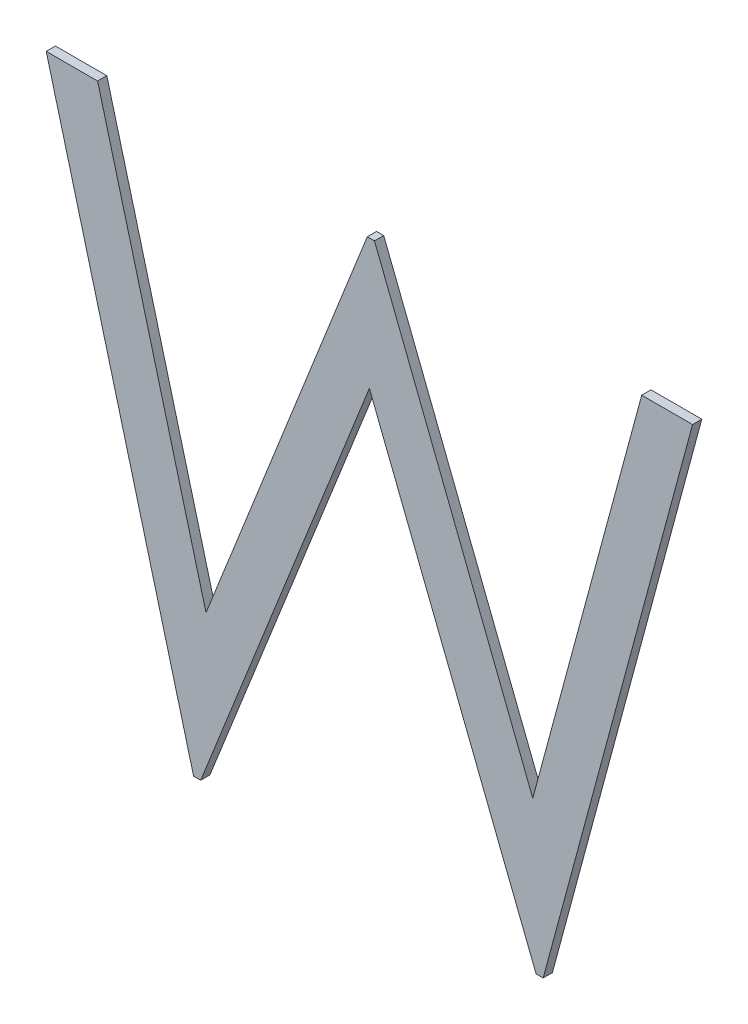
ISO-10303-21;
HEADER;
FILE_DESCRIPTION(('STEP AP214'),'2;1');
FILE_NAME('part.step','',(''),(''),'','','');
FILE_SCHEMA(('AUTOMOTIVE_DESIGN { 1 0 10303 214 1 1 1 1 }'));
ENDSEC;
DATA;
#1=APPLICATION_CONTEXT('core data for automotive mechanical design processes');
#2=APPLICATION_PROTOCOL_DEFINITION('international standard','automotive_design',2000,#1);
#3=PRODUCT_CONTEXT('',#1,'mechanical');
#4=PRODUCT('Part','Part','',(#3));
#5=PRODUCT_RELATED_PRODUCT_CATEGORY('part','',(#4));
#6=PRODUCT_DEFINITION_FORMATION('','',#4);
#7=PRODUCT_DEFINITION_CONTEXT('part definition',#1,'design');
#8=PRODUCT_DEFINITION('design','',#6,#7);
#9=PRODUCT_DEFINITION_SHAPE('','',#8);
#10=(LENGTH_UNIT() NAMED_UNIT(*) SI_UNIT(.MILLI.,.METRE.));
#11=(NAMED_UNIT(*) PLANE_ANGLE_UNIT() SI_UNIT($,.RADIAN.));
#12=(NAMED_UNIT(*) SI_UNIT($,.STERADIAN.) SOLID_ANGLE_UNIT());
#13=UNCERTAINTY_MEASURE_WITH_UNIT(LENGTH_MEASURE(1.E-05),#10,'distance_accuracy_value','');
#14=(GEOMETRIC_REPRESENTATION_CONTEXT(3) GLOBAL_UNCERTAINTY_ASSIGNED_CONTEXT((#13)) GLOBAL_UNIT_ASSIGNED_CONTEXT((#10,
#11,#12)) REPRESENTATION_CONTEXT('',''));
#15=CARTESIAN_POINT('',(0.,0.,0.));
#16=DIRECTION('',(0.,0.,1.));
#17=DIRECTION('',(1.,0.,0.));
#18=AXIS2_PLACEMENT_3D('',#15,#16,#17);
#19=CARTESIAN_POINT('',(0.595961538461539,0.858883956160389,0.551));
#20=DIRECTION('',(-0.966388993927676,-0.257084251589735,0.));
#21=DIRECTION('',(0.257084251589735,-0.966388993927676,0.));
#22=AXIS2_PLACEMENT_3D('',#19,#20,#21);
#23=PLANE('',#22);
#24=DIRECTION('',(-0.257084251589734,0.966388993927676,0.));
#25=VECTOR('',#24,1.);
#26=CARTESIAN_POINT('',(0.595961538461539,0.858883956160389,0.55));
#27=LINE('',#26,#25);
#28=CARTESIAN_POINT('',(0.595961538461539,0.858883956160389,0.55));
#29=VERTEX_POINT('',#28);
#30=CARTESIAN_POINT('',(0.58,0.918883956160389,0.55));
#31=VERTEX_POINT('',#30);
#32=EDGE_CURVE('E11',#29,#31,#27,.T.);
#33=ORIENTED_EDGE('',*,*,#32,.F.);
#34=DIRECTION('',(0.,0.,-1.));
#35=VECTOR('',#34,1.);
#36=CARTESIAN_POINT('',(0.595961538461539,0.858883956160389,0.551));
#37=LINE('',#36,#35);
#38=CARTESIAN_POINT('',(0.595961538461539,0.858883956160389,0.551));
#39=VERTEX_POINT('',#38);
#40=EDGE_CURVE('E224',#39,#29,#37,.T.);
#41=ORIENTED_EDGE('',*,*,#40,.F.);
#42=DIRECTION('',(-0.257084251589734,0.966388993927676,0.));
#43=VECTOR('',#42,1.);
#44=CARTESIAN_POINT('',(0.595961538461539,0.858883956160389,0.551));
#45=LINE('',#44,#43);
#46=CARTESIAN_POINT('',(0.58,0.918883956160389,0.551));
#47=VERTEX_POINT('',#46);
#48=EDGE_CURVE('E217',#39,#47,#45,.T.);
#49=ORIENTED_EDGE('',*,*,#48,.T.);
#50=DIRECTION('',(0.,0.,-1.));
#51=VECTOR('',#50,1.);
#52=CARTESIAN_POINT('',(0.58,0.918883956160389,0.551));
#53=LINE('',#52,#51);
#54=EDGE_CURVE('E127',#47,#31,#53,.T.);
#55=ORIENTED_EDGE('',*,*,#54,.T.);
#56=EDGE_LOOP('',(#33,#41,#49,#55));
#57=FACE_BOUND('',#56,.T.);
#58=ADVANCED_FACE('F17',(#57),#23,.T.);
#59=CARTESIAN_POINT('',(0.596730769230769,0.858883956160389,0.551));
#60=DIRECTION('',(0.,-1.,0.));
#61=DIRECTION('',(0.,0.,-1.));
#62=AXIS2_PLACEMENT_3D('',#59,#60,#61);
#63=PLANE('',#62);
#64=DIRECTION('',(-1.,0.,0.));
#65=VECTOR('',#64,1.);
#66=CARTESIAN_POINT('',(0.596730769230769,0.858883956160389,0.55));
#67=LINE('',#66,#65);
#68=CARTESIAN_POINT('',(0.596730769230769,0.858883956160389,0.55));
#69=VERTEX_POINT('',#68);
#70=EDGE_CURVE('E24',#69,#29,#67,.T.);
#71=ORIENTED_EDGE('',*,*,#70,.F.);
#72=DIRECTION('',(0.,0.,-1.));
#73=VECTOR('',#72,1.);
#74=CARTESIAN_POINT('',(0.596730769230769,0.858883956160389,0.551));
#75=LINE('',#74,#73);
#76=CARTESIAN_POINT('',(0.596730769230769,0.858883956160389,0.551));
#77=VERTEX_POINT('',#76);
#78=EDGE_CURVE('E219',#77,#69,#75,.T.);
#79=ORIENTED_EDGE('',*,*,#78,.F.);
#80=DIRECTION('',(-1.,0.,0.));
#81=VECTOR('',#80,1.);
#82=CARTESIAN_POINT('',(0.596730769230769,0.858883956160389,0.551));
#83=LINE('',#82,#81);
#84=EDGE_CURVE('E208',#77,#39,#83,.T.);
#85=ORIENTED_EDGE('',*,*,#84,.T.);
#86=ORIENTED_EDGE('',*,*,#40,.T.);
#87=EDGE_LOOP('',(#71,#79,#85,#86));
#88=FACE_BOUND('',#87,.T.);
#89=ADVANCED_FACE('F235',(#88),#63,.T.);
#90=CARTESIAN_POINT('',(0.615,0.904773379237312,0.551));
#91=DIRECTION('',(0.929079621725964,-0.369879786543601,0.));
#92=DIRECTION('',(0.369879786543601,0.929079621725964,0.));
#93=AXIS2_PLACEMENT_3D('',#90,#91,#92);
#94=PLANE('',#93);
#95=DIRECTION('',(-0.3698797865436,-0.929079621725964,0.));
#96=VECTOR('',#95,1.);
#97=CARTESIAN_POINT('',(0.615,0.904773379237312,0.55));
#98=LINE('',#97,#96);
#99=CARTESIAN_POINT('',(0.615,0.904773379237312,0.55));
#100=VERTEX_POINT('',#99);
#101=EDGE_CURVE('E221',#100,#69,#98,.T.);
#102=ORIENTED_EDGE('',*,*,#101,.F.);
#103=DIRECTION('',(0.,0.,-1.));
#104=VECTOR('',#103,1.);
#105=CARTESIAN_POINT('',(0.615,0.904773379237312,0.551));
#106=LINE('',#105,#104);
#107=CARTESIAN_POINT('',(0.615,0.904773379237312,0.551));
#108=VERTEX_POINT('',#107);
#109=EDGE_CURVE('E211',#108,#100,#106,.T.);
#110=ORIENTED_EDGE('',*,*,#109,.F.);
#111=DIRECTION('',(-0.3698797865436,-0.929079621725964,0.));
#112=VECTOR('',#111,1.);
#113=CARTESIAN_POINT('',(0.615,0.904773379237312,0.551));
#114=LINE('',#113,#112);
#115=EDGE_CURVE('E198',#108,#77,#114,.T.);
#116=ORIENTED_EDGE('',*,*,#115,.T.);
#117=ORIENTED_EDGE('',*,*,#78,.T.);
#118=EDGE_LOOP('',(#102,#110,#116,#117));
#119=FACE_BOUND('',#118,.T.);
#120=ADVANCED_FACE('F228',(#119),#94,.T.);
#121=CARTESIAN_POINT('',(0.633052884615385,0.858883956160389,0.551));
#122=DIRECTION('',(-0.930579564355999,-0.366089708135859,0.));
#123=DIRECTION('',(0.366089708135859,-0.930579564355999,0.));
#124=AXIS2_PLACEMENT_3D('',#121,#122,#123);
#125=PLANE('',#124);
#126=DIRECTION('',(-0.366089708135859,0.930579564355999,0.));
#127=VECTOR('',#126,1.);
#128=CARTESIAN_POINT('',(0.633052884615385,0.858883956160389,0.55));
#129=LINE('',#128,#127);
#130=CARTESIAN_POINT('',(0.633052884615385,0.858883956160389,0.55));
#131=VERTEX_POINT('',#130);
#132=EDGE_CURVE('E214',#131,#100,#129,.T.);
#133=ORIENTED_EDGE('',*,*,#132,.F.);
#134=DIRECTION('',(0.,0.,-1.));
#135=VECTOR('',#134,1.);
#136=CARTESIAN_POINT('',(0.633052884615385,0.858883956160389,0.551));
#137=LINE('',#136,#135);
#138=CARTESIAN_POINT('',(0.633052884615385,0.858883956160389,0.551));
#139=VERTEX_POINT('',#138);
#140=EDGE_CURVE('E201',#139,#131,#137,.T.);
#141=ORIENTED_EDGE('',*,*,#140,.F.);
#142=DIRECTION('',(-0.366089708135859,0.930579564355999,0.));
#143=VECTOR('',#142,1.);
#144=CARTESIAN_POINT('',(0.633052884615385,0.858883956160389,0.551));
#145=LINE('',#144,#143);
#146=EDGE_CURVE('E189',#139,#108,#145,.T.);
#147=ORIENTED_EDGE('',*,*,#146,.T.);
#148=ORIENTED_EDGE('',*,*,#109,.T.);
#149=EDGE_LOOP('',(#133,#141,#147,#148));
#150=FACE_BOUND('',#149,.T.);
#151=ADVANCED_FACE('F230',(#150),#125,.T.);
#152=CARTESIAN_POINT('',(0.633822115384616,0.858883956160389,0.551));
#153=DIRECTION('',(0.,-1.,0.));
#154=DIRECTION('',(0.,0.,-1.));
#155=AXIS2_PLACEMENT_3D('',#152,#153,#154);
#156=PLANE('',#155);
#157=DIRECTION('',(-1.,0.,0.));
#158=VECTOR('',#157,1.);
#159=CARTESIAN_POINT('',(0.633822115384616,0.858883956160389,0.55));
#160=LINE('',#159,#158);
#161=CARTESIAN_POINT('',(0.633822115384616,0.858883956160389,0.55));
#162=VERTEX_POINT('',#161);
#163=EDGE_CURVE('E204',#162,#131,#160,.T.);
#164=ORIENTED_EDGE('',*,*,#163,.F.);
#165=DIRECTION('',(0.,0.,-1.));
#166=VECTOR('',#165,1.);
#167=CARTESIAN_POINT('',(0.633822115384616,0.858883956160389,0.551));
#168=LINE('',#167,#166);
#169=CARTESIAN_POINT('',(0.633822115384616,0.858883956160389,0.551));
#170=VERTEX_POINT('',#169);
#171=EDGE_CURVE('E192',#170,#162,#168,.T.);
#172=ORIENTED_EDGE('',*,*,#171,.F.);
#173=DIRECTION('',(-1.,0.,0.));
#174=VECTOR('',#173,1.);
#175=CARTESIAN_POINT('',(0.633822115384616,0.858883956160389,0.551));
#176=LINE('',#175,#174);
#177=EDGE_CURVE('E180',#170,#139,#176,.T.);
#178=ORIENTED_EDGE('',*,*,#177,.T.);
#179=ORIENTED_EDGE('',*,*,#140,.T.);
#180=EDGE_LOOP('',(#164,#172,#178,#179));
#181=FACE_BOUND('',#180,.T.);
#182=ADVANCED_FACE('F253',(#181),#156,.T.);
#183=CARTESIAN_POINT('',(0.65,0.918883956160389,0.551));
#184=DIRECTION('',(0.965518584404461,-0.260334137541747,0.));
#185=DIRECTION('',(0.260334137541747,0.965518584404461,0.));
#186=AXIS2_PLACEMENT_3D('',#183,#184,#185);
#187=PLANE('',#186);
#188=DIRECTION('',(-0.260334137541746,-0.965518584404461,0.));
#189=VECTOR('',#188,1.);
#190=CARTESIAN_POINT('',(0.65,0.918883956160389,0.55));
#191=LINE('',#190,#189);
#192=CARTESIAN_POINT('',(0.65,0.918883956160389,0.55));
#193=VERTEX_POINT('',#192);
#194=EDGE_CURVE('E195',#193,#162,#191,.T.);
#195=ORIENTED_EDGE('',*,*,#194,.F.);
#196=DIRECTION('',(0.,0.,-1.));
#197=VECTOR('',#196,1.);
#198=CARTESIAN_POINT('',(0.65,0.918883956160389,0.551));
#199=LINE('',#198,#197);
#200=CARTESIAN_POINT('',(0.65,0.918883956160389,0.551));
#201=VERTEX_POINT('',#200);
#202=EDGE_CURVE('E183',#201,#193,#199,.T.);
#203=ORIENTED_EDGE('',*,*,#202,.F.);
#204=DIRECTION('',(-0.260334137541746,-0.965518584404461,0.));
#205=VECTOR('',#204,1.);
#206=CARTESIAN_POINT('',(0.65,0.918883956160389,0.551));
#207=LINE('',#206,#205);
#208=EDGE_CURVE('E171',#201,#170,#207,.T.);
#209=ORIENTED_EDGE('',*,*,#208,.T.);
#210=ORIENTED_EDGE('',*,*,#171,.T.);
#211=EDGE_LOOP('',(#195,#203,#209,#210));
#212=FACE_BOUND('',#211,.T.);
#213=ADVANCED_FACE('F251',(#212),#187,.T.);
#214=CARTESIAN_POINT('',(0.644495192307693,0.918883956160389,0.551));
#215=DIRECTION('',(0.,1.,0.));
#216=DIRECTION('',(0.,0.,1.));
#217=AXIS2_PLACEMENT_3D('',#214,#215,#216);
#218=PLANE('',#217);
#219=DIRECTION('',(1.,0.,0.));
#220=VECTOR('',#219,1.);
#221=CARTESIAN_POINT('',(0.644495192307693,0.918883956160389,0.55));
#222=LINE('',#221,#220);
#223=CARTESIAN_POINT('',(0.644495192307693,0.918883956160389,0.55));
#224=VERTEX_POINT('',#223);
#225=EDGE_CURVE('E186',#224,#193,#222,.T.);
#226=ORIENTED_EDGE('',*,*,#225,.F.);
#227=DIRECTION('',(0.,0.,-1.));
#228=VECTOR('',#227,1.);
#229=CARTESIAN_POINT('',(0.644495192307693,0.918883956160389,0.551));
#230=LINE('',#229,#228);
#231=CARTESIAN_POINT('',(0.644495192307693,0.918883956160389,0.551));
#232=VERTEX_POINT('',#231);
#233=EDGE_CURVE('E174',#232,#224,#230,.T.);
#234=ORIENTED_EDGE('',*,*,#233,.F.);
#235=DIRECTION('',(1.,0.,0.));
#236=VECTOR('',#235,1.);
#237=CARTESIAN_POINT('',(0.644495192307693,0.918883956160389,0.551));
#238=LINE('',#237,#236);
#239=EDGE_CURVE('E162',#232,#201,#238,.T.);
#240=ORIENTED_EDGE('',*,*,#239,.T.);
#241=ORIENTED_EDGE('',*,*,#202,.T.);
#242=EDGE_LOOP('',(#226,#234,#240,#241));
#243=FACE_BOUND('',#242,.T.);
#244=ADVANCED_FACE('F248',(#243),#218,.T.);
#245=CARTESIAN_POINT('',(0.632692307692308,0.875182033083466,0.551));
#246=DIRECTION('',(-0.965410371069074,0.260735144221626,0.));
#247=DIRECTION('',(-0.260735144221626,-0.965410371069074,0.));
#248=AXIS2_PLACEMENT_3D('',#245,#246,#247);
#249=PLANE('',#248);
#250=DIRECTION('',(0.260735144221626,0.965410371069074,0.));
#251=VECTOR('',#250,1.);
#252=CARTESIAN_POINT('',(0.632692307692308,0.875182033083466,0.55));
#253=LINE('',#252,#251);
#254=CARTESIAN_POINT('',(0.632692307692308,0.875182033083466,0.55));
#255=VERTEX_POINT('',#254);
#256=EDGE_CURVE('E177',#255,#224,#253,.T.);
#257=ORIENTED_EDGE('',*,*,#256,.F.);
#258=DIRECTION('',(0.,0.,-1.));
#259=VECTOR('',#258,1.);
#260=CARTESIAN_POINT('',(0.632692307692308,0.875182033083466,0.551));
#261=LINE('',#260,#259);
#262=CARTESIAN_POINT('',(0.632692307692308,0.875182033083466,0.551));
#263=VERTEX_POINT('',#262);
#264=EDGE_CURVE('E165',#263,#255,#261,.T.);
#265=ORIENTED_EDGE('',*,*,#264,.F.);
#266=DIRECTION('',(0.260735144221626,0.965410371069074,0.));
#267=VECTOR('',#266,1.);
#268=CARTESIAN_POINT('',(0.632692307692308,0.875182033083466,0.551));
#269=LINE('',#268,#267);
#270=EDGE_CURVE('E153',#263,#232,#269,.T.);
#271=ORIENTED_EDGE('',*,*,#270,.T.);
#272=ORIENTED_EDGE('',*,*,#233,.T.);
#273=EDGE_LOOP('',(#257,#265,#271,#272));
#274=FACE_BOUND('',#273,.T.);
#275=ADVANCED_FACE('F245',(#274),#249,.T.);
#276=CARTESIAN_POINT('',(0.615552884615385,0.918883956160389,0.551));
#277=DIRECTION('',(0.930962959917011,0.365113636095064,0.));
#278=DIRECTION('',(-0.365113636095064,0.930962959917011,0.));
#279=AXIS2_PLACEMENT_3D('',#276,#277,#278);
#280=PLANE('',#279);
#281=DIRECTION('',(0.365113636095065,-0.93096295991701,0.));
#282=VECTOR('',#281,1.);
#283=CARTESIAN_POINT('',(0.615552884615385,0.918883956160389,0.55));
#284=LINE('',#283,#282);
#285=CARTESIAN_POINT('',(0.615552884615385,0.918883956160389,0.55));
#286=VERTEX_POINT('',#285);
#287=EDGE_CURVE('E168',#286,#255,#284,.T.);
#288=ORIENTED_EDGE('',*,*,#287,.F.);
#289=DIRECTION('',(0.,0.,-1.));
#290=VECTOR('',#289,1.);
#291=CARTESIAN_POINT('',(0.615552884615385,0.918883956160389,0.551));
#292=LINE('',#291,#290);
#293=CARTESIAN_POINT('',(0.615552884615385,0.918883956160389,0.551));
#294=VERTEX_POINT('',#293);
#295=EDGE_CURVE('E156',#294,#286,#292,.T.);
#296=ORIENTED_EDGE('',*,*,#295,.F.);
#297=DIRECTION('',(0.365113636095065,-0.93096295991701,0.));
#298=VECTOR('',#297,1.);
#299=CARTESIAN_POINT('',(0.615552884615385,0.918883956160389,0.551));
#300=LINE('',#299,#298);
#301=EDGE_CURVE('E144',#294,#263,#300,.T.);
#302=ORIENTED_EDGE('',*,*,#301,.T.);
#303=ORIENTED_EDGE('',*,*,#264,.T.);
#304=EDGE_LOOP('',(#288,#296,#302,#303));
#305=FACE_BOUND('',#304,.T.);
#306=ADVANCED_FACE('F242',(#305),#280,.T.);
#307=CARTESIAN_POINT('',(0.614771634615385,0.918883956160389,0.551));
#308=DIRECTION('',(0.,1.,0.));
#309=DIRECTION('',(0.,0.,1.));
#310=AXIS2_PLACEMENT_3D('',#307,#308,#309);
#311=PLANE('',#310);
#312=DIRECTION('',(1.,0.,0.));
#313=VECTOR('',#312,1.);
#314=CARTESIAN_POINT('',(0.614771634615385,0.918883956160389,0.55));
#315=LINE('',#314,#313);
#316=CARTESIAN_POINT('',(0.614771634615385,0.918883956160389,0.55));
#317=VERTEX_POINT('',#316);
#318=EDGE_CURVE('E159',#317,#286,#315,.T.);
#319=ORIENTED_EDGE('',*,*,#318,.F.);
#320=DIRECTION('',(0.,0.,-1.));
#321=VECTOR('',#320,1.);
#322=CARTESIAN_POINT('',(0.614771634615385,0.918883956160389,0.551));
#323=LINE('',#322,#321);
#324=CARTESIAN_POINT('',(0.614771634615385,0.918883956160389,0.551));
#325=VERTEX_POINT('',#324);
#326=EDGE_CURVE('E147',#325,#317,#323,.T.);
#327=ORIENTED_EDGE('',*,*,#326,.F.);
#328=DIRECTION('',(1.,0.,0.));
#329=VECTOR('',#328,1.);
#330=CARTESIAN_POINT('',(0.614771634615385,0.918883956160389,0.551));
#331=LINE('',#330,#329);
#332=EDGE_CURVE('E138',#325,#294,#331,.T.);
#333=ORIENTED_EDGE('',*,*,#332,.T.);
#334=ORIENTED_EDGE('',*,*,#295,.T.);
#335=EDGE_LOOP('',(#319,#327,#333,#334));
#336=FACE_BOUND('',#335,.T.);
#337=ADVANCED_FACE('F239',(#336),#311,.T.);
#338=CARTESIAN_POINT('',(0.597307692307693,0.874881552314235,0.551));
#339=DIRECTION('',(-0.929471367358842,0.368894262980715,0.));
#340=DIRECTION('',(-0.368894262980715,-0.929471367358842,0.));
#341=AXIS2_PLACEMENT_3D('',#338,#339,#340);
#342=PLANE('',#341);
#343=DIRECTION('',(0.368894262980714,0.929471367358842,0.));
#344=VECTOR('',#343,1.);
#345=CARTESIAN_POINT('',(0.597307692307693,0.874881552314235,0.55));
#346=LINE('',#345,#344);
#347=CARTESIAN_POINT('',(0.597307692307693,0.874881552314235,0.55));
#348=VERTEX_POINT('',#347);
#349=EDGE_CURVE('E150',#348,#317,#346,.T.);
#350=ORIENTED_EDGE('',*,*,#349,.F.);
#351=DIRECTION('',(0.,0.,-1.));
#352=VECTOR('',#351,1.);
#353=CARTESIAN_POINT('',(0.597307692307693,0.874881552314235,0.551));
#354=LINE('',#353,#352);
#355=CARTESIAN_POINT('',(0.597307692307693,0.874881552314235,0.551));
#356=VERTEX_POINT('',#355);
#357=EDGE_CURVE('E141',#356,#348,#354,.T.);
#358=ORIENTED_EDGE('',*,*,#357,.F.);
#359=DIRECTION('',(0.368894262980714,0.929471367358842,0.));
#360=VECTOR('',#359,1.);
#361=CARTESIAN_POINT('',(0.597307692307693,0.874881552314235,0.551));
#362=LINE('',#361,#360);
#363=EDGE_CURVE('E121',#356,#325,#362,.T.);
#364=ORIENTED_EDGE('',*,*,#363,.T.);
#365=ORIENTED_EDGE('',*,*,#326,.T.);
#366=EDGE_LOOP('',(#350,#358,#364,#365));
#367=FACE_BOUND('',#366,.T.);
#368=ADVANCED_FACE('F237',(#367),#342,.T.);
#369=CARTESIAN_POINT('',(0.585564903846154,0.918883956160389,0.551));
#370=DIRECTION('',(0.966186739358345,0.257843333611884,0.));
#371=DIRECTION('',(-0.257843333611884,0.966186739358345,0.));
#372=AXIS2_PLACEMENT_3D('',#369,#370,#371);
#373=PLANE('',#372);
#374=DIRECTION('',(0.257843333611884,-0.966186739358345,0.));
#375=VECTOR('',#374,1.);
#376=CARTESIAN_POINT('',(0.585564903846154,0.918883956160389,0.55));
#377=LINE('',#376,#375);
#378=CARTESIAN_POINT('',(0.585564903846154,0.918883956160389,0.55));
#379=VERTEX_POINT('',#378);
#380=EDGE_CURVE('E116',#379,#348,#377,.T.);
#381=ORIENTED_EDGE('',*,*,#380,.F.);
#382=DIRECTION('',(0.,0.,-1.));
#383=VECTOR('',#382,1.);
#384=CARTESIAN_POINT('',(0.585564903846154,0.918883956160389,0.551));
#385=LINE('',#384,#383);
#386=CARTESIAN_POINT('',(0.585564903846154,0.918883956160389,0.551));
#387=VERTEX_POINT('',#386);
#388=EDGE_CURVE('E108',#387,#379,#385,.T.);
#389=ORIENTED_EDGE('',*,*,#388,.F.);
#390=DIRECTION('',(0.257843333611884,-0.966186739358345,0.));
#391=VECTOR('',#390,1.);
#392=CARTESIAN_POINT('',(0.585564903846154,0.918883956160389,0.551));
#393=LINE('',#392,#391);
#394=EDGE_CURVE('E113',#387,#356,#393,.T.);
#395=ORIENTED_EDGE('',*,*,#394,.T.);
#396=ORIENTED_EDGE('',*,*,#357,.T.);
#397=EDGE_LOOP('',(#381,#389,#395,#396));
#398=FACE_BOUND('',#397,.T.);
#399=ADVANCED_FACE('F110',(#398),#373,.T.);
#400=CARTESIAN_POINT('',(0.58,0.918883956160389,0.551));
#401=DIRECTION('',(0.,1.,0.));
#402=DIRECTION('',(0.,0.,1.));
#403=AXIS2_PLACEMENT_3D('',#400,#401,#402);
#404=PLANE('',#403);
#405=DIRECTION('',(1.,0.,0.));
#406=VECTOR('',#405,1.);
#407=CARTESIAN_POINT('',(0.58,0.918883956160389,0.55));
#408=LINE('',#407,#406);
#409=EDGE_CURVE('E120',#31,#379,#408,.T.);
#410=ORIENTED_EDGE('',*,*,#409,.F.);
#411=ORIENTED_EDGE('',*,*,#54,.F.);
#412=DIRECTION('',(1.,0.,0.));
#413=VECTOR('',#412,1.);
#414=CARTESIAN_POINT('',(0.58,0.918883956160389,0.551));
#415=LINE('',#414,#413);
#416=EDGE_CURVE('E125',#47,#387,#415,.T.);
#417=ORIENTED_EDGE('',*,*,#416,.T.);
#418=ORIENTED_EDGE('',*,*,#388,.T.);
#419=EDGE_LOOP('',(#410,#411,#417,#418));
#420=FACE_BOUND('',#419,.T.);
#421=ADVANCED_FACE('F126',(#420),#404,.T.);
#422=CARTESIAN_POINT('',(0.,0.,0.551));
#423=DIRECTION('',(0.,0.,-1.));
#424=DIRECTION('',(-1.,0.,0.));
#425=AXIS2_PLACEMENT_3D('',#422,#423,#424);
#426=PLANE('',#425);
#427=ORIENTED_EDGE('',*,*,#48,.F.);
#428=ORIENTED_EDGE('',*,*,#84,.F.);
#429=ORIENTED_EDGE('',*,*,#115,.F.);
#430=ORIENTED_EDGE('',*,*,#146,.F.);
#431=ORIENTED_EDGE('',*,*,#177,.F.);
#432=ORIENTED_EDGE('',*,*,#208,.F.);
#433=ORIENTED_EDGE('',*,*,#239,.F.);
#434=ORIENTED_EDGE('',*,*,#270,.F.);
#435=ORIENTED_EDGE('',*,*,#301,.F.);
#436=ORIENTED_EDGE('',*,*,#332,.F.);
#437=ORIENTED_EDGE('',*,*,#363,.F.);
#438=ORIENTED_EDGE('',*,*,#394,.F.);
#439=ORIENTED_EDGE('',*,*,#416,.F.);
#440=EDGE_LOOP('',(#427,#428,#429,#430,#431,#432,#433,#434,#435,#436,#437,#438,#439));
#441=FACE_BOUND('',#440,.T.);
#442=ADVANCED_FACE('F131',(#441),#426,.F.);
#443=CARTESIAN_POINT('',(0.,0.,0.55));
#444=DIRECTION('',(0.,0.,-1.));
#445=DIRECTION('',(-1.,0.,0.));
#446=AXIS2_PLACEMENT_3D('',#443,#444,#445);
#447=PLANE('',#446);
#448=ORIENTED_EDGE('',*,*,#32,.T.);
#449=ORIENTED_EDGE('',*,*,#409,.T.);
#450=ORIENTED_EDGE('',*,*,#380,.T.);
#451=ORIENTED_EDGE('',*,*,#349,.T.);
#452=ORIENTED_EDGE('',*,*,#318,.T.);
#453=ORIENTED_EDGE('',*,*,#287,.T.);
#454=ORIENTED_EDGE('',*,*,#256,.T.);
#455=ORIENTED_EDGE('',*,*,#225,.T.);
#456=ORIENTED_EDGE('',*,*,#194,.T.);
#457=ORIENTED_EDGE('',*,*,#163,.T.);
#458=ORIENTED_EDGE('',*,*,#132,.T.);
#459=ORIENTED_EDGE('',*,*,#101,.T.);
#460=ORIENTED_EDGE('',*,*,#70,.T.);
#461=EDGE_LOOP('',(#448,#449,#450,#451,#452,#453,#454,#455,#456,#457,#458,#459,#460));
#462=FACE_BOUND('',#461,.T.);
#463=ADVANCED_FACE('F226',(#462),#447,.T.);
#464=CLOSED_SHELL('',(#58,#89,#120,#151,#182,#213,#244,#275,#306,#337,#368,#399,#421,#442,#463));
#465=MANIFOLD_SOLID_BREP('B1',#464);
#466=ADVANCED_BREP_SHAPE_REPRESENTATION('',(#18,#465),#14);
#467=SHAPE_DEFINITION_REPRESENTATION(#9,#466);
ENDSEC;
END-ISO-10303-21;
